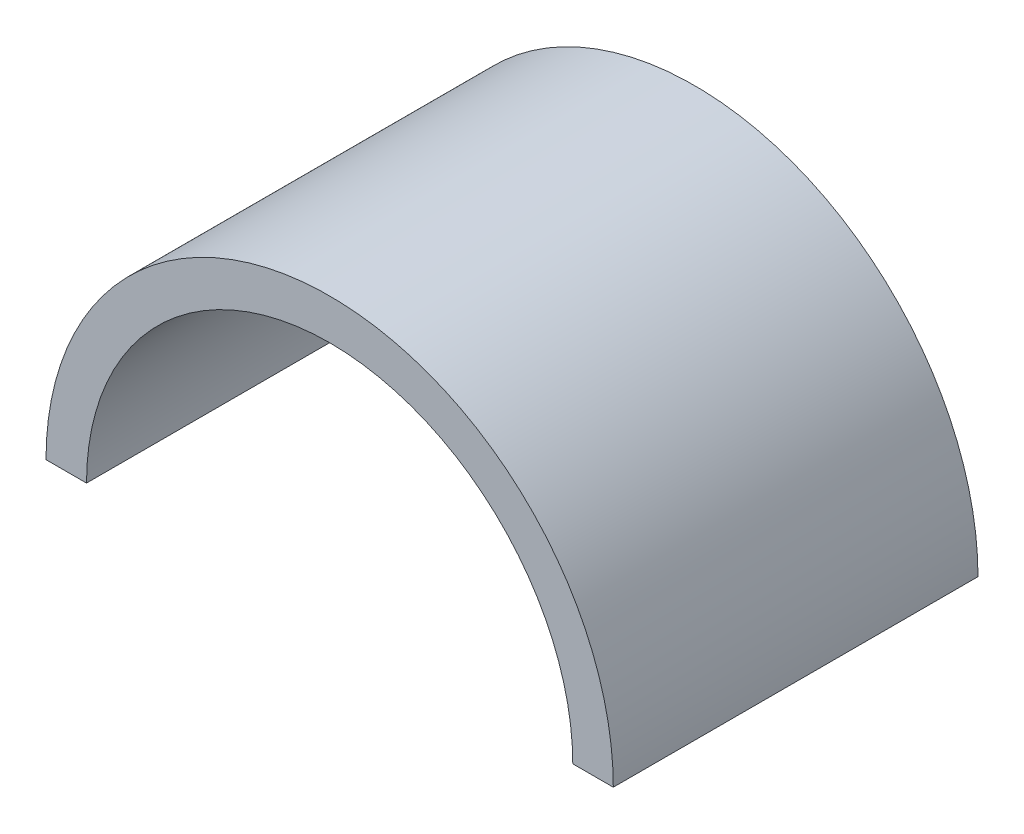
ISO-10303-21;
HEADER;
FILE_DESCRIPTION(('STEP AP214'),'2;1');
FILE_NAME('part.step','',(''),(''),'','','');
FILE_SCHEMA(('AUTOMOTIVE_DESIGN { 1 0 10303 214 1 1 1 1 }'));
ENDSEC;
DATA;
#1=APPLICATION_CONTEXT('core data for automotive mechanical design processes');
#2=APPLICATION_PROTOCOL_DEFINITION('international standard','automotive_design',2000,#1);
#3=PRODUCT_CONTEXT('',#1,'mechanical');
#4=PRODUCT('Part','Part','',(#3));
#5=PRODUCT_RELATED_PRODUCT_CATEGORY('part','',(#4));
#6=PRODUCT_DEFINITION_FORMATION('','',#4);
#7=PRODUCT_DEFINITION_CONTEXT('part definition',#1,'design');
#8=PRODUCT_DEFINITION('design','',#6,#7);
#9=PRODUCT_DEFINITION_SHAPE('','',#8);
#10=(LENGTH_UNIT() NAMED_UNIT(*) SI_UNIT(.MILLI.,.METRE.));
#11=(NAMED_UNIT(*) PLANE_ANGLE_UNIT() SI_UNIT($,.RADIAN.));
#12=(NAMED_UNIT(*) SI_UNIT($,.STERADIAN.) SOLID_ANGLE_UNIT());
#13=UNCERTAINTY_MEASURE_WITH_UNIT(LENGTH_MEASURE(1.E-05),#10,'distance_accuracy_value','');
#14=(GEOMETRIC_REPRESENTATION_CONTEXT(3) GLOBAL_UNCERTAINTY_ASSIGNED_CONTEXT((#13)) GLOBAL_UNIT_ASSIGNED_CONTEXT((#10,
#11,#12)) REPRESENTATION_CONTEXT('',''));
#15=CARTESIAN_POINT('',(0.,0.,0.));
#16=DIRECTION('',(0.,0.,1.));
#17=DIRECTION('',(1.,0.,0.));
#18=AXIS2_PLACEMENT_3D('',#15,#16,#17);
#19=CARTESIAN_POINT('',(0.,0.,9.));
#20=DIRECTION('',(0.,-1.,0.));
#21=DIRECTION('',(0.,0.,-1.));
#22=AXIS2_PLACEMENT_3D('',#19,#20,#21);
#23=PLANE('',#22);
#24=DIRECTION('',(-1.,0.,0.));
#25=VECTOR('',#24,1.);
#26=CARTESIAN_POINT('',(0.,0.,0.));
#27=LINE('',#26,#25);
#28=CARTESIAN_POINT('',(7.,0.,0.));
#29=VERTEX_POINT('',#28);
#30=CARTESIAN_POINT('',(6.,0.,0.));
#31=VERTEX_POINT('',#30);
#32=EDGE_CURVE('E122',#29,#31,#27,.T.);
#33=ORIENTED_EDGE('',*,*,#32,.F.);
#34=DIRECTION('',(0.,0.,-1.));
#35=VECTOR('',#34,1.);
#36=CARTESIAN_POINT('',(7.,0.,9.));
#37=LINE('',#36,#35);
#38=CARTESIAN_POINT('',(7.,0.,9.));
#39=VERTEX_POINT('',#38);
#40=EDGE_CURVE('E11',#39,#29,#37,.T.);
#41=ORIENTED_EDGE('',*,*,#40,.F.);
#42=DIRECTION('',(-1.,0.,0.));
#43=VECTOR('',#42,1.);
#44=CARTESIAN_POINT('',(0.,0.,9.));
#45=LINE('',#44,#43);
#46=CARTESIAN_POINT('',(6.,0.,9.));
#47=VERTEX_POINT('',#46);
#48=EDGE_CURVE('E97',#39,#47,#45,.T.);
#49=ORIENTED_EDGE('',*,*,#48,.T.);
#50=DIRECTION('',(0.,0.,-1.));
#51=VECTOR('',#50,1.);
#52=CARTESIAN_POINT('',(6.,0.,9.));
#53=LINE('',#52,#51);
#54=EDGE_CURVE('E65',#47,#31,#53,.T.);
#55=ORIENTED_EDGE('',*,*,#54,.T.);
#56=EDGE_LOOP('',(#33,#41,#49,#55));
#57=FACE_BOUND('',#56,.T.);
#58=ADVANCED_FACE('F47',(#57),#23,.T.);
#59=CARTESIAN_POINT('',(0.,0.,9.));
#60=DIRECTION('',(0.,0.,-1.));
#61=DIRECTION('',(-1.,0.,0.));
#62=AXIS2_PLACEMENT_3D('',#59,#60,#61);
#63=CYLINDRICAL_SURFACE('',#62,7.);
#64=CARTESIAN_POINT('',(0.,0.,0.));
#65=DIRECTION('',(0.,0.,1.));
#66=DIRECTION('',(1.,0.,0.));
#67=AXIS2_PLACEMENT_3D('',#64,#65,#66);
#68=CIRCLE('',#67,7.);
#69=CARTESIAN_POINT('',(-7.,0.,0.));
#70=VERTEX_POINT('',#69);
#71=EDGE_CURVE('E103',#29,#70,#68,.T.);
#72=ORIENTED_EDGE('',*,*,#71,.T.);
#73=DIRECTION('',(0.,0.,-1.));
#74=VECTOR('',#73,1.);
#75=CARTESIAN_POINT('',(-7.,0.,9.));
#76=LINE('',#75,#74);
#77=CARTESIAN_POINT('',(-7.,0.,9.));
#78=VERTEX_POINT('',#77);
#79=EDGE_CURVE('E57',#78,#70,#76,.T.);
#80=ORIENTED_EDGE('',*,*,#79,.F.);
#81=CARTESIAN_POINT('',(0.,0.,9.));
#82=DIRECTION('',(0.,0.,1.));
#83=DIRECTION('',(1.,0.,0.));
#84=AXIS2_PLACEMENT_3D('',#81,#82,#83);
#85=CIRCLE('',#84,7.);
#86=EDGE_CURVE('E91',#39,#78,#85,.T.);
#87=ORIENTED_EDGE('',*,*,#86,.F.);
#88=ORIENTED_EDGE('',*,*,#40,.T.);
#89=EDGE_LOOP('',(#72,#80,#87,#88));
#90=FACE_BOUND('',#89,.T.);
#91=ADVANCED_FACE('F49',(#90),#63,.T.);
#92=CARTESIAN_POINT('',(-6.,0.,0.));
#93=VERTEX_POINT('',#92);
#94=EDGE_CURVE('E117',#93,#70,#27,.T.);
#95=ORIENTED_EDGE('',*,*,#94,.F.);
#96=DIRECTION('',(0.,0.,-1.));
#97=VECTOR('',#96,1.);
#98=CARTESIAN_POINT('',(-6.,0.,9.));
#99=LINE('',#98,#97);
#100=CARTESIAN_POINT('',(-6.,0.,9.));
#101=VERTEX_POINT('',#100);
#102=EDGE_CURVE('E78',#101,#93,#99,.T.);
#103=ORIENTED_EDGE('',*,*,#102,.F.);
#104=EDGE_CURVE('E96',#101,#78,#45,.T.);
#105=ORIENTED_EDGE('',*,*,#104,.T.);
#106=ORIENTED_EDGE('',*,*,#79,.T.);
#107=EDGE_LOOP('',(#95,#103,#105,#106));
#108=FACE_BOUND('',#107,.T.);
#109=ADVANCED_FACE('F107',(#108),#23,.T.);
#110=CARTESIAN_POINT('',(0.,0.,9.));
#111=DIRECTION('',(0.,0.,-1.));
#112=DIRECTION('',(-1.,0.,0.));
#113=AXIS2_PLACEMENT_3D('',#110,#111,#112);
#114=CYLINDRICAL_SURFACE('',#113,6.);
#115=CARTESIAN_POINT('',(0.,0.,0.));
#116=DIRECTION('',(0.,0.,1.));
#117=DIRECTION('',(1.,0.,0.));
#118=AXIS2_PLACEMENT_3D('',#115,#116,#117);
#119=CIRCLE('',#118,6.);
#120=EDGE_CURVE('E114',#31,#93,#119,.T.);
#121=ORIENTED_EDGE('',*,*,#120,.F.);
#122=ORIENTED_EDGE('',*,*,#54,.F.);
#123=CARTESIAN_POINT('',(0.,0.,9.));
#124=DIRECTION('',(0.,0.,1.));
#125=DIRECTION('',(1.,0.,0.));
#126=AXIS2_PLACEMENT_3D('',#123,#124,#125);
#127=CIRCLE('',#126,6.);
#128=EDGE_CURVE('E109',#47,#101,#127,.T.);
#129=ORIENTED_EDGE('',*,*,#128,.T.);
#130=ORIENTED_EDGE('',*,*,#102,.T.);
#131=EDGE_LOOP('',(#121,#122,#129,#130));
#132=FACE_BOUND('',#131,.T.);
#133=ADVANCED_FACE('F131',(#132),#114,.F.);
#134=CARTESIAN_POINT('',(0.,0.,9.));
#135=DIRECTION('',(0.,0.,1.));
#136=DIRECTION('',(1.,0.,0.));
#137=AXIS2_PLACEMENT_3D('',#134,#135,#136);
#138=PLANE('',#137);
#139=ORIENTED_EDGE('',*,*,#48,.F.);
#140=ORIENTED_EDGE('',*,*,#86,.T.);
#141=ORIENTED_EDGE('',*,*,#104,.F.);
#142=ORIENTED_EDGE('',*,*,#128,.F.);
#143=EDGE_LOOP('',(#139,#140,#141,#142));
#144=FACE_BOUND('',#143,.T.);
#145=ADVANCED_FACE('F93',(#144),#138,.T.);
#146=CARTESIAN_POINT('',(0.,0.,0.));
#147=DIRECTION('',(0.,0.,1.));
#148=DIRECTION('',(1.,0.,0.));
#149=AXIS2_PLACEMENT_3D('',#146,#147,#148);
#150=PLANE('',#149);
#151=ORIENTED_EDGE('',*,*,#32,.T.);
#152=ORIENTED_EDGE('',*,*,#120,.T.);
#153=ORIENTED_EDGE('',*,*,#94,.T.);
#154=ORIENTED_EDGE('',*,*,#71,.F.);
#155=EDGE_LOOP('',(#151,#152,#153,#154));
#156=FACE_BOUND('',#155,.T.);
#157=ADVANCED_FACE('F130',(#156),#150,.F.);
#158=CLOSED_SHELL('',(#58,#91,#109,#133,#145,#157));
#159=MANIFOLD_SOLID_BREP('B2',#158);
#160=ADVANCED_BREP_SHAPE_REPRESENTATION('',(#18,#159),#14);
#161=SHAPE_DEFINITION_REPRESENTATION(#9,#160);
ENDSEC;
END-ISO-10303-21;
